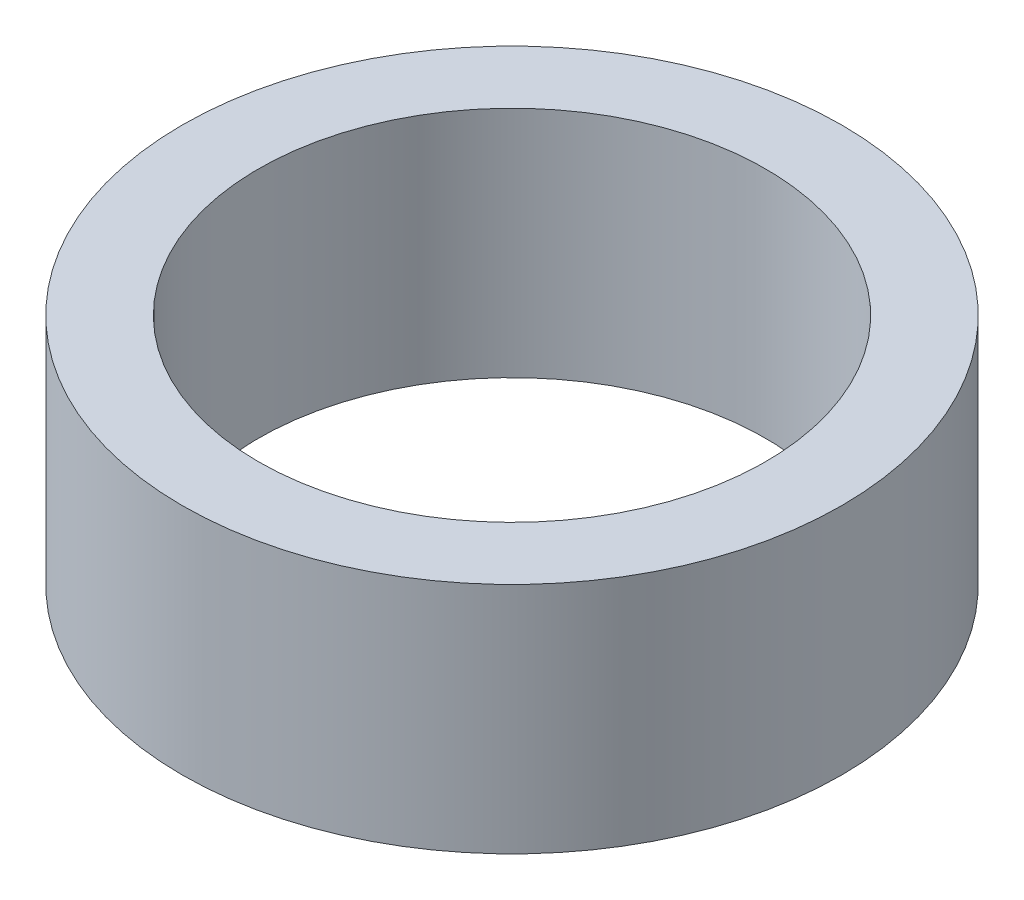
ISO-10303-21;
HEADER;
FILE_DESCRIPTION(('STEP AP214'),'2;1');
FILE_NAME('part.step','',(''),(''),'','','');
FILE_SCHEMA(('AUTOMOTIVE_DESIGN { 1 0 10303 214 1 1 1 1 }'));
ENDSEC;
DATA;
#1=APPLICATION_CONTEXT('core data for automotive mechanical design processes');
#2=APPLICATION_PROTOCOL_DEFINITION('international standard','automotive_design',2000,#1);
#3=PRODUCT_CONTEXT('',#1,'mechanical');
#4=PRODUCT('Part','Part','',(#3));
#5=PRODUCT_RELATED_PRODUCT_CATEGORY('part','',(#4));
#6=PRODUCT_DEFINITION_FORMATION('','',#4);
#7=PRODUCT_DEFINITION_CONTEXT('part definition',#1,'design');
#8=PRODUCT_DEFINITION('design','',#6,#7);
#9=PRODUCT_DEFINITION_SHAPE('','',#8);
#10=(LENGTH_UNIT() NAMED_UNIT(*) SI_UNIT(.MILLI.,.METRE.));
#11=(NAMED_UNIT(*) PLANE_ANGLE_UNIT() SI_UNIT($,.RADIAN.));
#12=(NAMED_UNIT(*) SI_UNIT($,.STERADIAN.) SOLID_ANGLE_UNIT());
#13=UNCERTAINTY_MEASURE_WITH_UNIT(LENGTH_MEASURE(1.E-05),#10,'distance_accuracy_value','');
#14=(GEOMETRIC_REPRESENTATION_CONTEXT(3) GLOBAL_UNCERTAINTY_ASSIGNED_CONTEXT((#13)) GLOBAL_UNIT_ASSIGNED_CONTEXT((#10,
#11,#12)) REPRESENTATION_CONTEXT('',''));
#15=CARTESIAN_POINT('',(0.,0.,0.));
#16=DIRECTION('',(0.,0.,1.));
#17=DIRECTION('',(1.,0.,0.));
#18=AXIS2_PLACEMENT_3D('',#15,#16,#17);
#19=CARTESIAN_POINT('',(0.,23.,0.));
#20=DIRECTION('',(0.,-1.,0.));
#21=DIRECTION('',(0.,0.,-1.));
#22=AXIS2_PLACEMENT_3D('',#19,#20,#21);
#23=CYLINDRICAL_SURFACE('',#22,32.5);
#24=CARTESIAN_POINT('',(0.,23.,0.));
#25=DIRECTION('',(0.,1.,0.));
#26=DIRECTION('',(0.,0.,1.));
#27=AXIS2_PLACEMENT_3D('',#24,#25,#26);
#28=CIRCLE('',#27,32.5);
#29=CARTESIAN_POINT('',(0.,23.,32.5));
#30=VERTEX_POINT('',#29);
#31=EDGE_CURVE('E10',#30,#30,#28,.T.);
#32=ORIENTED_EDGE('',*,*,#31,.F.);
#33=EDGE_LOOP('',(#32));
#34=FACE_BOUND('',#33,.T.);
#35=CARTESIAN_POINT('',(0.,0.,0.));
#36=DIRECTION('',(0.,1.,0.));
#37=DIRECTION('',(0.,0.,1.));
#38=AXIS2_PLACEMENT_3D('',#35,#36,#37);
#39=CIRCLE('',#38,32.5);
#40=CARTESIAN_POINT('',(0.,0.,32.5));
#41=VERTEX_POINT('',#40);
#42=EDGE_CURVE('E37',#41,#41,#39,.T.);
#43=ORIENTED_EDGE('',*,*,#42,.T.);
#44=EDGE_LOOP('',(#43));
#45=FACE_BOUND('',#44,.T.);
#46=ADVANCED_FACE('F40',(#34,#45),#23,.T.);
#47=CARTESIAN_POINT('',(0.,23.,0.));
#48=DIRECTION('',(0.,1.,0.));
#49=DIRECTION('',(0.,0.,1.));
#50=AXIS2_PLACEMENT_3D('',#47,#48,#49);
#51=PLANE('',#50);
#52=CARTESIAN_POINT('',(0.,23.,0.));
#53=DIRECTION('',(0.,1.,0.));
#54=DIRECTION('',(0.,0.,1.));
#55=AXIS2_PLACEMENT_3D('',#52,#53,#54);
#56=CIRCLE('',#55,25.);
#57=CARTESIAN_POINT('',(0.,23.,25.));
#58=VERTEX_POINT('',#57);
#59=EDGE_CURVE('E50',#58,#58,#56,.T.);
#60=ORIENTED_EDGE('',*,*,#59,.F.);
#61=EDGE_LOOP('',(#60));
#62=FACE_BOUND('',#61,.T.);
#63=ORIENTED_EDGE('',*,*,#31,.T.);
#64=EDGE_LOOP('',(#63));
#65=FACE_BOUND('',#64,.T.);
#66=ADVANCED_FACE('F59',(#62,#65),#51,.T.);
#67=CARTESIAN_POINT('',(0.,0.,0.));
#68=DIRECTION('',(0.,1.,0.));
#69=DIRECTION('',(0.,0.,1.));
#70=AXIS2_PLACEMENT_3D('',#67,#68,#69);
#71=PLANE('',#70);
#72=CARTESIAN_POINT('',(0.,0.,0.));
#73=DIRECTION('',(0.,1.,0.));
#74=DIRECTION('',(0.,0.,1.));
#75=AXIS2_PLACEMENT_3D('',#72,#73,#74);
#76=CIRCLE('',#75,25.);
#77=CARTESIAN_POINT('',(0.,0.,25.));
#78=VERTEX_POINT('',#77);
#79=EDGE_CURVE('E47',#78,#78,#76,.T.);
#80=ORIENTED_EDGE('',*,*,#79,.T.);
#81=EDGE_LOOP('',(#80));
#82=FACE_BOUND('',#81,.T.);
#83=ORIENTED_EDGE('',*,*,#42,.F.);
#84=EDGE_LOOP('',(#83));
#85=FACE_BOUND('',#84,.T.);
#86=ADVANCED_FACE('F58',(#82,#85),#71,.F.);
#87=CARTESIAN_POINT('',(0.,23.,0.));
#88=DIRECTION('',(0.,-1.,0.));
#89=DIRECTION('',(0.,0.,-1.));
#90=AXIS2_PLACEMENT_3D('',#87,#88,#89);
#91=CYLINDRICAL_SURFACE('',#90,25.);
#92=ORIENTED_EDGE('',*,*,#59,.T.);
#93=EDGE_LOOP('',(#92));
#94=FACE_BOUND('',#93,.T.);
#95=ORIENTED_EDGE('',*,*,#79,.F.);
#96=EDGE_LOOP('',(#95));
#97=FACE_BOUND('',#96,.T.);
#98=ADVANCED_FACE('F54',(#94,#97),#91,.F.);
#99=CLOSED_SHELL('',(#46,#66,#86,#98));
#100=MANIFOLD_SOLID_BREP('B2',#99);
#101=ADVANCED_BREP_SHAPE_REPRESENTATION('',(#18,#100),#14);
#102=SHAPE_DEFINITION_REPRESENTATION(#9,#101);
ENDSEC;
END-ISO-10303-21;
